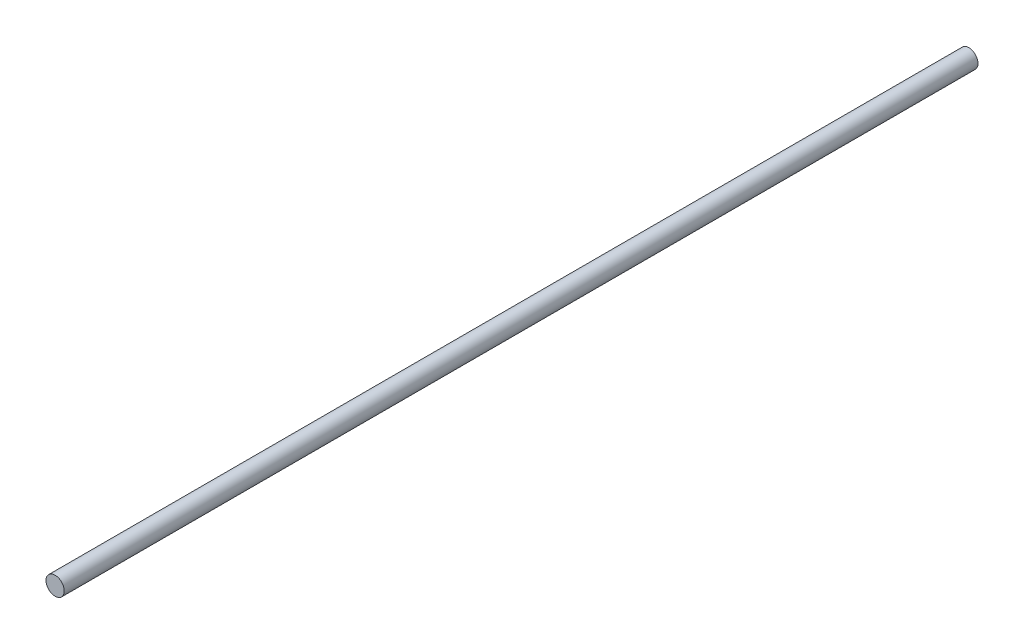
ISO-10303-21;
HEADER;
FILE_DESCRIPTION(('STEP AP214'),'2;1');
FILE_NAME('part.step','',(''),(''),'','','');
FILE_SCHEMA(('AUTOMOTIVE_DESIGN { 1 0 10303 214 1 1 1 1 }'));
ENDSEC;
DATA;
#1=APPLICATION_CONTEXT('core data for automotive mechanical design processes');
#2=APPLICATION_PROTOCOL_DEFINITION('international standard','automotive_design',2000,#1);
#3=PRODUCT_CONTEXT('',#1,'mechanical');
#4=PRODUCT('Part','Part','',(#3));
#5=PRODUCT_RELATED_PRODUCT_CATEGORY('part','',(#4));
#6=PRODUCT_DEFINITION_FORMATION('','',#4);
#7=PRODUCT_DEFINITION_CONTEXT('part definition',#1,'design');
#8=PRODUCT_DEFINITION('design','',#6,#7);
#9=PRODUCT_DEFINITION_SHAPE('','',#8);
#10=(LENGTH_UNIT() NAMED_UNIT(*) SI_UNIT(.MILLI.,.METRE.));
#11=(NAMED_UNIT(*) PLANE_ANGLE_UNIT() SI_UNIT($,.RADIAN.));
#12=(NAMED_UNIT(*) SI_UNIT($,.STERADIAN.) SOLID_ANGLE_UNIT());
#13=UNCERTAINTY_MEASURE_WITH_UNIT(LENGTH_MEASURE(1.E-05),#10,'distance_accuracy_value','');
#14=(GEOMETRIC_REPRESENTATION_CONTEXT(3) GLOBAL_UNCERTAINTY_ASSIGNED_CONTEXT((#13)) GLOBAL_UNIT_ASSIGNED_CONTEXT((#10,
#11,#12)) REPRESENTATION_CONTEXT('',''));
#15=CARTESIAN_POINT('',(0.,0.,0.));
#16=DIRECTION('',(0.,0.,1.));
#17=DIRECTION('',(1.,0.,0.));
#18=AXIS2_PLACEMENT_3D('',#15,#16,#17);
#19=CARTESIAN_POINT('',(0.,0.,304.8));
#20=DIRECTION('',(0.,0.,-1.));
#21=DIRECTION('',(-1.,0.,0.));
#22=AXIS2_PLACEMENT_3D('',#19,#20,#21);
#23=CYLINDRICAL_SURFACE('',#22,3.048);
#24=CARTESIAN_POINT('',(0.,0.,304.8));
#25=DIRECTION('',(0.,0.,1.));
#26=DIRECTION('',(1.,0.,0.));
#27=AXIS2_PLACEMENT_3D('',#24,#25,#26);
#28=CIRCLE('',#27,3.048);
#29=CARTESIAN_POINT('',(3.048,0.,304.8));
#30=VERTEX_POINT('',#29);
#31=EDGE_CURVE('E10',#30,#30,#28,.T.);
#32=ORIENTED_EDGE('',*,*,#31,.F.);
#33=EDGE_LOOP('',(#32));
#34=FACE_BOUND('',#33,.T.);
#35=CARTESIAN_POINT('',(0.,0.,0.));
#36=DIRECTION('',(0.,0.,1.));
#37=DIRECTION('',(1.,0.,0.));
#38=AXIS2_PLACEMENT_3D('',#35,#36,#37);
#39=CIRCLE('',#38,3.048);
#40=CARTESIAN_POINT('',(3.048,0.,0.));
#41=VERTEX_POINT('',#40);
#42=EDGE_CURVE('E33',#41,#41,#39,.T.);
#43=ORIENTED_EDGE('',*,*,#42,.T.);
#44=EDGE_LOOP('',(#43));
#45=FACE_BOUND('',#44,.T.);
#46=ADVANCED_FACE('F30',(#34,#45),#23,.T.);
#47=CARTESIAN_POINT('',(0.,0.,304.8));
#48=DIRECTION('',(0.,0.,1.));
#49=DIRECTION('',(1.,0.,0.));
#50=AXIS2_PLACEMENT_3D('',#47,#48,#49);
#51=PLANE('',#50);
#52=ORIENTED_EDGE('',*,*,#31,.T.);
#53=EDGE_LOOP('',(#52));
#54=FACE_BOUND('',#53,.T.);
#55=ADVANCED_FACE('F45',(#54),#51,.T.);
#56=CARTESIAN_POINT('',(0.,0.,0.));
#57=DIRECTION('',(0.,0.,1.));
#58=DIRECTION('',(1.,0.,0.));
#59=AXIS2_PLACEMENT_3D('',#56,#57,#58);
#60=PLANE('',#59);
#61=ORIENTED_EDGE('',*,*,#42,.F.);
#62=EDGE_LOOP('',(#61));
#63=FACE_BOUND('',#62,.T.);
#64=ADVANCED_FACE('F43',(#63),#60,.F.);
#65=CLOSED_SHELL('',(#46,#55,#64));
#66=MANIFOLD_SOLID_BREP('B2',#65);
#67=ADVANCED_BREP_SHAPE_REPRESENTATION('',(#18,#66),#14);
#68=SHAPE_DEFINITION_REPRESENTATION(#9,#67);
ENDSEC;
END-ISO-10303-21;
